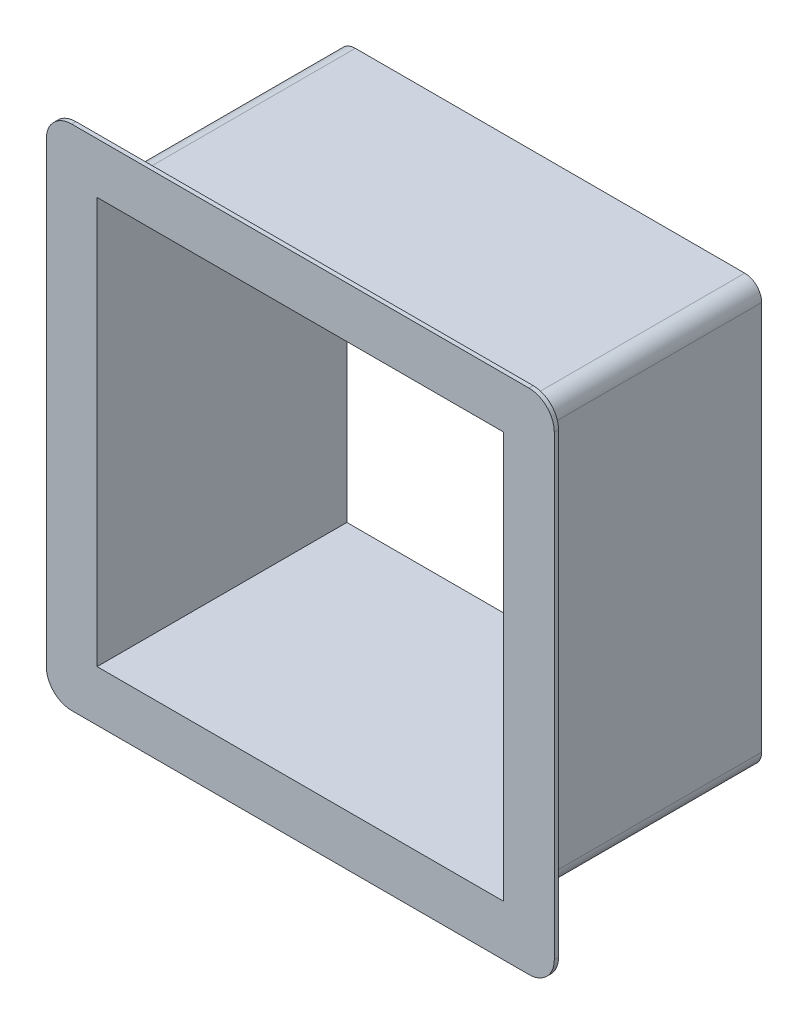
ISO-10303-21;
HEADER;
FILE_DESCRIPTION(('STEP AP214'),'2;1');
FILE_NAME('part.step','',(''),(''),'','','');
FILE_SCHEMA(('AUTOMOTIVE_DESIGN { 1 0 10303 214 1 1 1 1 }'));
ENDSEC;
DATA;
#1=APPLICATION_CONTEXT('core data for automotive mechanical design processes');
#2=APPLICATION_PROTOCOL_DEFINITION('international standard','automotive_design',2000,#1);
#3=PRODUCT_CONTEXT('',#1,'mechanical');
#4=PRODUCT('Part','Part','',(#3));
#5=PRODUCT_RELATED_PRODUCT_CATEGORY('part','',(#4));
#6=PRODUCT_DEFINITION_FORMATION('','',#4);
#7=PRODUCT_DEFINITION_CONTEXT('part definition',#1,'design');
#8=PRODUCT_DEFINITION('design','',#6,#7);
#9=PRODUCT_DEFINITION_SHAPE('','',#8);
#10=(LENGTH_UNIT() NAMED_UNIT(*) SI_UNIT(.MILLI.,.METRE.));
#11=(NAMED_UNIT(*) PLANE_ANGLE_UNIT() SI_UNIT($,.RADIAN.));
#12=(NAMED_UNIT(*) SI_UNIT($,.STERADIAN.) SOLID_ANGLE_UNIT());
#13=UNCERTAINTY_MEASURE_WITH_UNIT(LENGTH_MEASURE(1.E-05),#10,'distance_accuracy_value','');
#14=(GEOMETRIC_REPRESENTATION_CONTEXT(3) GLOBAL_UNCERTAINTY_ASSIGNED_CONTEXT((#13)) GLOBAL_UNIT_ASSIGNED_CONTEXT((#10,
#11,#12)) REPRESENTATION_CONTEXT('',''));
#15=CARTESIAN_POINT('',(0.,0.,0.));
#16=DIRECTION('',(0.,0.,1.));
#17=DIRECTION('',(1.,0.,0.));
#18=AXIS2_PLACEMENT_3D('',#15,#16,#17);
#19=CARTESIAN_POINT('',(-50.,-50.,-59.));
#20=DIRECTION('',(0.,-1.,0.));
#21=DIRECTION('',(0.,0.,-1.));
#22=AXIS2_PLACEMENT_3D('',#19,#20,#21);
#23=PLANE('',#22);
#24=DIRECTION('',(1.,0.,0.));
#25=VECTOR('',#24,1.);
#26=CARTESIAN_POINT('',(-50.,-50.,-59.));
#27=LINE('',#26,#25);
#28=CARTESIAN_POINT('',(-46.,-50.,-59.));
#29=VERTEX_POINT('',#28);
#30=CARTESIAN_POINT('',(46.,-50.,-59.));
#31=VERTEX_POINT('',#30);
#32=EDGE_CURVE('E265',#29,#31,#27,.T.);
#33=ORIENTED_EDGE('',*,*,#32,.T.);
#34=DIRECTION('',(0.,0.,1.));
#35=VECTOR('',#34,1.);
#36=CARTESIAN_POINT('',(46.,-50.,-59.));
#37=LINE('',#36,#35);
#38=CARTESIAN_POINT('',(46.,-50.,-1.));
#39=VERTEX_POINT('',#38);
#40=EDGE_CURVE('E282',#31,#39,#37,.T.);
#41=ORIENTED_EDGE('',*,*,#40,.T.);
#42=DIRECTION('',(1.,0.,0.));
#43=VECTOR('',#42,1.);
#44=CARTESIAN_POINT('',(-50.,-50.,-1.));
#45=LINE('',#44,#43);
#46=CARTESIAN_POINT('',(-46.,-50.,-1.));
#47=VERTEX_POINT('',#46);
#48=EDGE_CURVE('E384',#47,#39,#45,.T.);
#49=ORIENTED_EDGE('',*,*,#48,.F.);
#50=DIRECTION('',(0.,0.,1.));
#51=VECTOR('',#50,1.);
#52=CARTESIAN_POINT('',(-46.,-50.,-59.));
#53=LINE('',#52,#51);
#54=EDGE_CURVE('E280',#47,#29,#53,.F.);
#55=ORIENTED_EDGE('',*,*,#54,.T.);
#56=EDGE_LOOP('',(#33,#41,#49,#55));
#57=FACE_BOUND('',#56,.T.);
#58=ADVANCED_FACE('F84',(#57),#23,.T.);
#59=CARTESIAN_POINT('',(-50.,-50.,-59.));
#60=DIRECTION('',(1.,0.,0.));
#61=DIRECTION('',(0.,0.,-1.));
#62=AXIS2_PLACEMENT_3D('',#59,#60,#61);
#63=PLANE('',#62);
#64=DIRECTION('',(0.,1.,0.));
#65=VECTOR('',#64,1.);
#66=CARTESIAN_POINT('',(-50.,-50.,-59.));
#67=LINE('',#66,#65);
#68=CARTESIAN_POINT('',(-50.,-46.,-59.));
#69=VERTEX_POINT('',#68);
#70=CARTESIAN_POINT('',(-50.,46.,-59.));
#71=VERTEX_POINT('',#70);
#72=EDGE_CURVE('E277',#69,#71,#67,.T.);
#73=ORIENTED_EDGE('',*,*,#72,.F.);
#74=DIRECTION('',(0.,0.,1.));
#75=VECTOR('',#74,1.);
#76=CARTESIAN_POINT('',(-50.,-46.,-1.));
#77=LINE('',#76,#75);
#78=CARTESIAN_POINT('',(-50.,-46.,-1.));
#79=VERTEX_POINT('',#78);
#80=EDGE_CURVE('E300',#69,#79,#77,.T.);
#81=ORIENTED_EDGE('',*,*,#80,.T.);
#82=DIRECTION('',(0.,1.,0.));
#83=VECTOR('',#82,1.);
#84=CARTESIAN_POINT('',(-50.,-50.,-1.));
#85=LINE('',#84,#83);
#86=CARTESIAN_POINT('',(-50.,46.,-1.));
#87=VERTEX_POINT('',#86);
#88=EDGE_CURVE('E370',#79,#87,#85,.T.);
#89=ORIENTED_EDGE('',*,*,#88,.T.);
#90=DIRECTION('',(0.,0.,1.));
#91=VECTOR('',#90,1.);
#92=CARTESIAN_POINT('',(-50.,46.,-59.));
#93=LINE('',#92,#91);
#94=EDGE_CURVE('E298',#87,#71,#93,.F.);
#95=ORIENTED_EDGE('',*,*,#94,.T.);
#96=EDGE_LOOP('',(#73,#81,#89,#95));
#97=FACE_BOUND('',#96,.T.);
#98=ADVANCED_FACE('F403',(#97),#63,.F.);
#99=CARTESIAN_POINT('',(-50.,50.,-59.));
#100=DIRECTION('',(0.,-1.,0.));
#101=DIRECTION('',(0.,0.,-1.));
#102=AXIS2_PLACEMENT_3D('',#99,#100,#101);
#103=PLANE('',#102);
#104=DIRECTION('',(1.,0.,0.));
#105=VECTOR('',#104,1.);
#106=CARTESIAN_POINT('',(-50.,50.,-59.));
#107=LINE('',#106,#105);
#108=CARTESIAN_POINT('',(-46.,50.,-59.));
#109=VERTEX_POINT('',#108);
#110=CARTESIAN_POINT('',(46.,50.,-59.));
#111=VERTEX_POINT('',#110);
#112=EDGE_CURVE('E274',#109,#111,#107,.T.);
#113=ORIENTED_EDGE('',*,*,#112,.F.);
#114=DIRECTION('',(0.,0.,1.));
#115=VECTOR('',#114,1.);
#116=CARTESIAN_POINT('',(-46.,50.,-59.));
#117=LINE('',#116,#115);
#118=CARTESIAN_POINT('',(-46.,50.,-1.));
#119=VERTEX_POINT('',#118);
#120=EDGE_CURVE('E305',#109,#119,#117,.T.);
#121=ORIENTED_EDGE('',*,*,#120,.T.);
#122=DIRECTION('',(1.,0.,0.));
#123=VECTOR('',#122,1.);
#124=CARTESIAN_POINT('',(-50.,50.,-1.));
#125=LINE('',#124,#123);
#126=CARTESIAN_POINT('',(46.,50.,-1.));
#127=VERTEX_POINT('',#126);
#128=EDGE_CURVE('E378',#119,#127,#125,.T.);
#129=ORIENTED_EDGE('',*,*,#128,.T.);
#130=DIRECTION('',(0.,0.,1.));
#131=VECTOR('',#130,1.);
#132=CARTESIAN_POINT('',(46.,50.,-59.));
#133=LINE('',#132,#131);
#134=EDGE_CURVE('E303',#127,#111,#133,.F.);
#135=ORIENTED_EDGE('',*,*,#134,.T.);
#136=EDGE_LOOP('',(#113,#121,#129,#135));
#137=FACE_BOUND('',#136,.T.);
#138=ADVANCED_FACE('F411',(#137),#103,.F.);
#139=CARTESIAN_POINT('',(50.,-50.,-59.));
#140=DIRECTION('',(1.,0.,0.));
#141=DIRECTION('',(0.,0.,-1.));
#142=AXIS2_PLACEMENT_3D('',#139,#140,#141);
#143=PLANE('',#142);
#144=DIRECTION('',(0.,1.,0.));
#145=VECTOR('',#144,1.);
#146=CARTESIAN_POINT('',(50.,-50.,-1.));
#147=LINE('',#146,#145);
#148=CARTESIAN_POINT('',(50.,-46.,-1.));
#149=VERTEX_POINT('',#148);
#150=CARTESIAN_POINT('',(50.,46.,-1.));
#151=VERTEX_POINT('',#150);
#152=EDGE_CURVE('E381',#149,#151,#147,.T.);
#153=ORIENTED_EDGE('',*,*,#152,.F.);
#154=DIRECTION('',(0.,0.,1.));
#155=VECTOR('',#154,1.);
#156=CARTESIAN_POINT('',(50.,-46.,-59.));
#157=LINE('',#156,#155);
#158=CARTESIAN_POINT('',(50.,-46.,-59.));
#159=VERTEX_POINT('',#158);
#160=EDGE_CURVE('E288',#149,#159,#157,.F.);
#161=ORIENTED_EDGE('',*,*,#160,.T.);
#162=DIRECTION('',(0.,1.,0.));
#163=VECTOR('',#162,1.);
#164=CARTESIAN_POINT('',(50.,-50.,-59.));
#165=LINE('',#164,#163);
#166=CARTESIAN_POINT('',(50.,46.,-59.));
#167=VERTEX_POINT('',#166);
#168=EDGE_CURVE('E271',#159,#167,#165,.T.);
#169=ORIENTED_EDGE('',*,*,#168,.T.);
#170=DIRECTION('',(0.,0.,1.));
#171=VECTOR('',#170,1.);
#172=CARTESIAN_POINT('',(50.,46.,-1.));
#173=LINE('',#172,#171);
#174=EDGE_CURVE('E285',#167,#151,#173,.T.);
#175=ORIENTED_EDGE('',*,*,#174,.T.);
#176=EDGE_LOOP('',(#153,#161,#169,#175));
#177=FACE_BOUND('',#176,.T.);
#178=ADVANCED_FACE('F419',(#177),#143,.T.);
#179=CARTESIAN_POINT('',(0.,0.,-59.));
#180=DIRECTION('',(0.,0.,1.));
#181=DIRECTION('',(1.,0.,0.));
#182=AXIS2_PLACEMENT_3D('',#179,#180,#181);
#183=PLANE('',#182);
#184=DIRECTION('',(0.,1.,0.));
#185=VECTOR('',#184,1.);
#186=CARTESIAN_POINT('',(-48.,-48.,-59.));
#187=LINE('',#186,#185);
#188=CARTESIAN_POINT('',(-48.,-48.,-59.));
#189=VERTEX_POINT('',#188);
#190=CARTESIAN_POINT('',(-48.,48.,-59.));
#191=VERTEX_POINT('',#190);
#192=EDGE_CURVE('E234',#189,#191,#187,.T.);
#193=ORIENTED_EDGE('',*,*,#192,.F.);
#194=DIRECTION('',(1.,0.,0.));
#195=VECTOR('',#194,1.);
#196=CARTESIAN_POINT('',(-48.,-48.,-59.));
#197=LINE('',#196,#195);
#198=CARTESIAN_POINT('',(48.,-48.,-59.));
#199=VERTEX_POINT('',#198);
#200=EDGE_CURVE('E226',#189,#199,#197,.T.);
#201=ORIENTED_EDGE('',*,*,#200,.T.);
#202=DIRECTION('',(0.,1.,0.));
#203=VECTOR('',#202,1.);
#204=CARTESIAN_POINT('',(48.,-48.,-59.));
#205=LINE('',#204,#203);
#206=CARTESIAN_POINT('',(48.,48.,-59.));
#207=VERTEX_POINT('',#206);
#208=EDGE_CURVE('E237',#199,#207,#205,.T.);
#209=ORIENTED_EDGE('',*,*,#208,.T.);
#210=DIRECTION('',(1.,0.,0.));
#211=VECTOR('',#210,1.);
#212=CARTESIAN_POINT('',(-48.,48.,-59.));
#213=LINE('',#212,#211);
#214=EDGE_CURVE('E242',#191,#207,#213,.T.);
#215=ORIENTED_EDGE('',*,*,#214,.F.);
#216=EDGE_LOOP('',(#193,#201,#209,#215));
#217=FACE_BOUND('',#216,.T.);
#218=ORIENTED_EDGE('',*,*,#168,.F.);
#219=CARTESIAN_POINT('',(46.,-46.,-59.));
#220=DIRECTION('',(0.,0.,1.));
#221=DIRECTION('',(1.,0.,0.));
#222=AXIS2_PLACEMENT_3D('',#219,#220,#221);
#223=CIRCLE('',#222,4.);
#224=EDGE_CURVE('E296',#159,#31,#223,.F.);
#225=ORIENTED_EDGE('',*,*,#224,.T.);
#226=ORIENTED_EDGE('',*,*,#32,.F.);
#227=CARTESIAN_POINT('',(-46.,-46.,-59.));
#228=DIRECTION('',(0.,0.,1.));
#229=DIRECTION('',(1.,0.,0.));
#230=AXIS2_PLACEMENT_3D('',#227,#228,#229);
#231=CIRCLE('',#230,4.);
#232=EDGE_CURVE('E294',#29,#69,#231,.F.);
#233=ORIENTED_EDGE('',*,*,#232,.T.);
#234=ORIENTED_EDGE('',*,*,#72,.T.);
#235=CARTESIAN_POINT('',(-46.,46.,-59.));
#236=DIRECTION('',(0.,0.,1.));
#237=DIRECTION('',(1.,0.,0.));
#238=AXIS2_PLACEMENT_3D('',#235,#236,#237);
#239=CIRCLE('',#238,4.);
#240=EDGE_CURVE('E292',#71,#109,#239,.F.);
#241=ORIENTED_EDGE('',*,*,#240,.T.);
#242=ORIENTED_EDGE('',*,*,#112,.T.);
#243=CARTESIAN_POINT('',(46.,46.,-59.));
#244=DIRECTION('',(0.,0.,1.));
#245=DIRECTION('',(1.,0.,0.));
#246=AXIS2_PLACEMENT_3D('',#243,#244,#245);
#247=CIRCLE('',#246,4.);
#248=EDGE_CURVE('E290',#111,#167,#247,.F.);
#249=ORIENTED_EDGE('',*,*,#248,.T.);
#250=EDGE_LOOP('',(#218,#225,#226,#233,#234,#241,#242,#249));
#251=FACE_BOUND('',#250,.T.);
#252=ADVANCED_FACE('F244',(#217,#251),#183,.F.);
#253=CARTESIAN_POINT('',(0.,0.,0.));
#254=DIRECTION('',(0.,0.,1.));
#255=DIRECTION('',(1.,0.,0.));
#256=AXIS2_PLACEMENT_3D('',#253,#254,#255);
#257=PLANE('',#256);
#258=DIRECTION('',(1.,0.,0.));
#259=VECTOR('',#258,1.);
#260=CARTESIAN_POINT('',(-48.,-48.,0.));
#261=LINE('',#260,#259);
#262=CARTESIAN_POINT('',(-48.,-48.,0.));
#263=VERTEX_POINT('',#262);
#264=CARTESIAN_POINT('',(48.,-48.,0.));
#265=VERTEX_POINT('',#264);
#266=EDGE_CURVE('E229',#263,#265,#261,.T.);
#267=ORIENTED_EDGE('',*,*,#266,.F.);
#268=DIRECTION('',(0.,1.,0.));
#269=VECTOR('',#268,1.);
#270=CARTESIAN_POINT('',(-48.,-48.,0.));
#271=LINE('',#270,#269);
#272=CARTESIAN_POINT('',(-48.,48.,0.));
#273=VERTEX_POINT('',#272);
#274=EDGE_CURVE('E246',#263,#273,#271,.T.);
#275=ORIENTED_EDGE('',*,*,#274,.T.);
#276=DIRECTION('',(1.,0.,0.));
#277=VECTOR('',#276,1.);
#278=CARTESIAN_POINT('',(-48.,48.,0.));
#279=LINE('',#278,#277);
#280=CARTESIAN_POINT('',(48.,48.,0.));
#281=VERTEX_POINT('',#280);
#282=EDGE_CURVE('E249',#273,#281,#279,.T.);
#283=ORIENTED_EDGE('',*,*,#282,.T.);
#284=DIRECTION('',(0.,1.,0.));
#285=VECTOR('',#284,1.);
#286=CARTESIAN_POINT('',(48.,-48.,0.));
#287=LINE('',#286,#285);
#288=EDGE_CURVE('E258',#265,#281,#287,.T.);
#289=ORIENTED_EDGE('',*,*,#288,.F.);
#290=EDGE_LOOP('',(#267,#275,#283,#289));
#291=FACE_BOUND('',#290,.T.);
#292=DIRECTION('',(1.,0.,0.));
#293=VECTOR('',#292,1.);
#294=CARTESIAN_POINT('',(-60.,-60.,0.));
#295=LINE('',#294,#293);
#296=CARTESIAN_POINT('',(-54.,-60.,0.));
#297=VERTEX_POINT('',#296);
#298=CARTESIAN_POINT('',(54.,-60.,0.));
#299=VERTEX_POINT('',#298);
#300=EDGE_CURVE('E366',#297,#299,#295,.T.);
#301=ORIENTED_EDGE('',*,*,#300,.T.);
#302=CARTESIAN_POINT('',(54.,-54.,0.));
#303=DIRECTION('',(0.,0.,1.));
#304=DIRECTION('',(1.,0.,0.));
#305=AXIS2_PLACEMENT_3D('',#302,#303,#304);
#306=CIRCLE('',#305,6.);
#307=CARTESIAN_POINT('',(60.,-54.,0.));
#308=VERTEX_POINT('',#307);
#309=EDGE_CURVE('E327',#299,#308,#306,.T.);
#310=ORIENTED_EDGE('',*,*,#309,.T.);
#311=DIRECTION('',(0.,1.,0.));
#312=VECTOR('',#311,1.);
#313=CARTESIAN_POINT('',(60.,-60.,0.));
#314=LINE('',#313,#312);
#315=CARTESIAN_POINT('',(60.,54.,0.));
#316=VERTEX_POINT('',#315);
#317=EDGE_CURVE('E364',#308,#316,#314,.T.);
#318=ORIENTED_EDGE('',*,*,#317,.T.);
#319=CARTESIAN_POINT('',(54.,54.,0.));
#320=DIRECTION('',(0.,0.,1.));
#321=DIRECTION('',(1.,0.,0.));
#322=AXIS2_PLACEMENT_3D('',#319,#320,#321);
#323=CIRCLE('',#322,6.);
#324=CARTESIAN_POINT('',(54.,60.,0.));
#325=VERTEX_POINT('',#324);
#326=EDGE_CURVE('E321',#316,#325,#323,.T.);
#327=ORIENTED_EDGE('',*,*,#326,.T.);
#328=DIRECTION('',(1.,0.,0.));
#329=VECTOR('',#328,1.);
#330=CARTESIAN_POINT('',(-60.,60.,0.));
#331=LINE('',#330,#329);
#332=CARTESIAN_POINT('',(-54.,60.,0.));
#333=VERTEX_POINT('',#332);
#334=EDGE_CURVE('E360',#333,#325,#331,.T.);
#335=ORIENTED_EDGE('',*,*,#334,.F.);
#336=CARTESIAN_POINT('',(-54.,54.,0.));
#337=DIRECTION('',(0.,0.,1.));
#338=DIRECTION('',(1.,0.,0.));
#339=AXIS2_PLACEMENT_3D('',#336,#337,#338);
#340=CIRCLE('',#339,6.);
#341=CARTESIAN_POINT('',(-60.,54.,0.));
#342=VERTEX_POINT('',#341);
#343=EDGE_CURVE('E323',#333,#342,#340,.T.);
#344=ORIENTED_EDGE('',*,*,#343,.T.);
#345=DIRECTION('',(0.,1.,0.));
#346=VECTOR('',#345,1.);
#347=CARTESIAN_POINT('',(-60.,-60.,0.));
#348=LINE('',#347,#346);
#349=CARTESIAN_POINT('',(-60.,-54.,0.));
#350=VERTEX_POINT('',#349);
#351=EDGE_CURVE('E252',#350,#342,#348,.T.);
#352=ORIENTED_EDGE('',*,*,#351,.F.);
#353=CARTESIAN_POINT('',(-54.,-54.,0.));
#354=DIRECTION('',(0.,0.,1.));
#355=DIRECTION('',(1.,0.,0.));
#356=AXIS2_PLACEMENT_3D('',#353,#354,#355);
#357=CIRCLE('',#356,6.);
#358=EDGE_CURVE('E325',#350,#297,#357,.T.);
#359=ORIENTED_EDGE('',*,*,#358,.T.);
#360=EDGE_LOOP('',(#301,#310,#318,#327,#335,#344,#352,#359));
#361=FACE_BOUND('',#360,.T.);
#362=ADVANCED_FACE('F356',(#291,#361),#257,.T.);
#363=CARTESIAN_POINT('',(-48.,-48.,-59.));
#364=DIRECTION('',(0.,-1.,0.));
#365=DIRECTION('',(0.,0.,-1.));
#366=AXIS2_PLACEMENT_3D('',#363,#364,#365);
#367=PLANE('',#366);
#368=ORIENTED_EDGE('',*,*,#266,.T.);
#369=DIRECTION('',(0.,0.,1.));
#370=VECTOR('',#369,1.);
#371=CARTESIAN_POINT('',(48.,-48.,-59.));
#372=LINE('',#371,#370);
#373=EDGE_CURVE('E222',#199,#265,#372,.T.);
#374=ORIENTED_EDGE('',*,*,#373,.F.);
#375=ORIENTED_EDGE('',*,*,#200,.F.);
#376=DIRECTION('',(0.,0.,1.));
#377=VECTOR('',#376,1.);
#378=CARTESIAN_POINT('',(-48.,-48.,-59.));
#379=LINE('',#378,#377);
#380=EDGE_CURVE('E263',#189,#263,#379,.T.);
#381=ORIENTED_EDGE('',*,*,#380,.T.);
#382=EDGE_LOOP('',(#368,#374,#375,#381));
#383=FACE_BOUND('',#382,.T.);
#384=ADVANCED_FACE('F224',(#383),#367,.F.);
#385=CARTESIAN_POINT('',(-48.,-48.,-59.));
#386=DIRECTION('',(1.,0.,0.));
#387=DIRECTION('',(0.,0.,-1.));
#388=AXIS2_PLACEMENT_3D('',#385,#386,#387);
#389=PLANE('',#388);
#390=ORIENTED_EDGE('',*,*,#274,.F.);
#391=ORIENTED_EDGE('',*,*,#380,.F.);
#392=ORIENTED_EDGE('',*,*,#192,.T.);
#393=DIRECTION('',(0.,0.,1.));
#394=VECTOR('',#393,1.);
#395=CARTESIAN_POINT('',(-48.,48.,-59.));
#396=LINE('',#395,#394);
#397=EDGE_CURVE('E266',#191,#273,#396,.T.);
#398=ORIENTED_EDGE('',*,*,#397,.T.);
#399=EDGE_LOOP('',(#390,#391,#392,#398));
#400=FACE_BOUND('',#399,.T.);
#401=ADVANCED_FACE('F452',(#400),#389,.T.);
#402=CARTESIAN_POINT('',(-48.,48.,-59.));
#403=DIRECTION('',(0.,-1.,0.));
#404=DIRECTION('',(0.,0.,-1.));
#405=AXIS2_PLACEMENT_3D('',#402,#403,#404);
#406=PLANE('',#405);
#407=ORIENTED_EDGE('',*,*,#282,.F.);
#408=ORIENTED_EDGE('',*,*,#397,.F.);
#409=ORIENTED_EDGE('',*,*,#214,.T.);
#410=DIRECTION('',(0.,0.,1.));
#411=VECTOR('',#410,1.);
#412=CARTESIAN_POINT('',(48.,48.,-59.));
#413=LINE('',#412,#411);
#414=EDGE_CURVE('E233',#207,#281,#413,.T.);
#415=ORIENTED_EDGE('',*,*,#414,.T.);
#416=EDGE_LOOP('',(#407,#408,#409,#415));
#417=FACE_BOUND('',#416,.T.);
#418=ADVANCED_FACE('F456',(#417),#406,.T.);
#419=CARTESIAN_POINT('',(48.,-48.,-59.));
#420=DIRECTION('',(1.,0.,0.));
#421=DIRECTION('',(0.,0.,-1.));
#422=AXIS2_PLACEMENT_3D('',#419,#420,#421);
#423=PLANE('',#422);
#424=ORIENTED_EDGE('',*,*,#288,.T.);
#425=ORIENTED_EDGE('',*,*,#414,.F.);
#426=ORIENTED_EDGE('',*,*,#208,.F.);
#427=ORIENTED_EDGE('',*,*,#373,.T.);
#428=EDGE_LOOP('',(#424,#425,#426,#427));
#429=FACE_BOUND('',#428,.T.);
#430=ADVANCED_FACE('F238',(#429),#423,.F.);
#431=CARTESIAN_POINT('',(-60.,-60.,-1.));
#432=DIRECTION('',(0.,-1.,0.));
#433=DIRECTION('',(0.,0.,-1.));
#434=AXIS2_PLACEMENT_3D('',#431,#432,#433);
#435=PLANE('',#434);
#436=DIRECTION('',(1.,0.,0.));
#437=VECTOR('',#436,1.);
#438=CARTESIAN_POINT('',(-60.,-60.,-1.));
#439=LINE('',#438,#437);
#440=CARTESIAN_POINT('',(-54.,-60.,-1.));
#441=VERTEX_POINT('',#440);
#442=CARTESIAN_POINT('',(54.,-60.,-1.));
#443=VERTEX_POINT('',#442);
#444=EDGE_CURVE('E359',#441,#443,#439,.T.);
#445=ORIENTED_EDGE('',*,*,#444,.T.);
#446=DIRECTION('',(0.,0.,1.));
#447=VECTOR('',#446,1.);
#448=CARTESIAN_POINT('',(54.,-60.,-1.));
#449=LINE('',#448,#447);
#450=EDGE_CURVE('E318',#443,#299,#449,.T.);
#451=ORIENTED_EDGE('',*,*,#450,.T.);
#452=ORIENTED_EDGE('',*,*,#300,.F.);
#453=DIRECTION('',(0.,0.,1.));
#454=VECTOR('',#453,1.);
#455=CARTESIAN_POINT('',(-54.,-60.,-1.));
#456=LINE('',#455,#454);
#457=EDGE_CURVE('E316',#297,#441,#456,.F.);
#458=ORIENTED_EDGE('',*,*,#457,.T.);
#459=EDGE_LOOP('',(#445,#451,#452,#458));
#460=FACE_BOUND('',#459,.T.);
#461=ADVANCED_FACE('F455',(#460),#435,.T.);
#462=CARTESIAN_POINT('',(-60.,-60.,-1.));
#463=DIRECTION('',(1.,0.,0.));
#464=DIRECTION('',(0.,0.,-1.));
#465=AXIS2_PLACEMENT_3D('',#462,#463,#464);
#466=PLANE('',#465);
#467=DIRECTION('',(0.,1.,0.));
#468=VECTOR('',#467,1.);
#469=CARTESIAN_POINT('',(-60.,-60.,-1.));
#470=LINE('',#469,#468);
#471=CARTESIAN_POINT('',(-60.,-54.,-1.));
#472=VERTEX_POINT('',#471);
#473=CARTESIAN_POINT('',(-60.,54.,-1.));
#474=VERTEX_POINT('',#473);
#475=EDGE_CURVE('E259',#472,#474,#470,.T.);
#476=ORIENTED_EDGE('',*,*,#475,.F.);
#477=DIRECTION('',(0.,0.,1.));
#478=VECTOR('',#477,1.);
#479=CARTESIAN_POINT('',(-60.,-54.,0.));
#480=LINE('',#479,#478);
#481=EDGE_CURVE('E343',#472,#350,#480,.T.);
#482=ORIENTED_EDGE('',*,*,#481,.T.);
#483=ORIENTED_EDGE('',*,*,#351,.T.);
#484=DIRECTION('',(0.,0.,1.));
#485=VECTOR('',#484,1.);
#486=CARTESIAN_POINT('',(-60.,54.,-1.));
#487=LINE('',#486,#485);
#488=EDGE_CURVE('E341',#342,#474,#487,.F.);
#489=ORIENTED_EDGE('',*,*,#488,.T.);
#490=EDGE_LOOP('',(#476,#482,#483,#489));
#491=FACE_BOUND('',#490,.T.);
#492=ADVANCED_FACE('F350',(#491),#466,.F.);
#493=CARTESIAN_POINT('',(-60.,60.,-1.));
#494=DIRECTION('',(0.,-1.,0.));
#495=DIRECTION('',(0.,0.,-1.));
#496=AXIS2_PLACEMENT_3D('',#493,#494,#495);
#497=PLANE('',#496);
#498=DIRECTION('',(1.,0.,0.));
#499=VECTOR('',#498,1.);
#500=CARTESIAN_POINT('',(-60.,60.,-1.));
#501=LINE('',#500,#499);
#502=CARTESIAN_POINT('',(-54.,60.,-1.));
#503=VERTEX_POINT('',#502);
#504=CARTESIAN_POINT('',(54.,60.,-1.));
#505=VERTEX_POINT('',#504);
#506=EDGE_CURVE('E372',#503,#505,#501,.T.);
#507=ORIENTED_EDGE('',*,*,#506,.F.);
#508=DIRECTION('',(0.,0.,1.));
#509=VECTOR('',#508,1.);
#510=CARTESIAN_POINT('',(-54.,60.,-1.));
#511=LINE('',#510,#509);
#512=EDGE_CURVE('E12',#503,#333,#511,.T.);
#513=ORIENTED_EDGE('',*,*,#512,.T.);
#514=ORIENTED_EDGE('',*,*,#334,.T.);
#515=DIRECTION('',(0.,0.,1.));
#516=VECTOR('',#515,1.);
#517=CARTESIAN_POINT('',(54.,60.,-1.));
#518=LINE('',#517,#516);
#519=EDGE_CURVE('E92',#325,#505,#518,.F.);
#520=ORIENTED_EDGE('',*,*,#519,.T.);
#521=EDGE_LOOP('',(#507,#513,#514,#520));
#522=FACE_BOUND('',#521,.T.);
#523=ADVANCED_FACE('F468',(#522),#497,.F.);
#524=CARTESIAN_POINT('',(60.,-60.,-1.));
#525=DIRECTION('',(1.,0.,0.));
#526=DIRECTION('',(0.,0.,-1.));
#527=AXIS2_PLACEMENT_3D('',#524,#525,#526);
#528=PLANE('',#527);
#529=ORIENTED_EDGE('',*,*,#317,.F.);
#530=DIRECTION('',(0.,0.,1.));
#531=VECTOR('',#530,1.);
#532=CARTESIAN_POINT('',(60.,-54.,-1.));
#533=LINE('',#532,#531);
#534=CARTESIAN_POINT('',(60.,-54.,-1.));
#535=VERTEX_POINT('',#534);
#536=EDGE_CURVE('E332',#308,#535,#533,.F.);
#537=ORIENTED_EDGE('',*,*,#536,.T.);
#538=DIRECTION('',(0.,1.,0.));
#539=VECTOR('',#538,1.);
#540=CARTESIAN_POINT('',(60.,-60.,-1.));
#541=LINE('',#540,#539);
#542=CARTESIAN_POINT('',(60.,54.,-1.));
#543=VERTEX_POINT('',#542);
#544=EDGE_CURVE('E362',#535,#543,#541,.T.);
#545=ORIENTED_EDGE('',*,*,#544,.T.);
#546=DIRECTION('',(0.,0.,1.));
#547=VECTOR('',#546,1.);
#548=CARTESIAN_POINT('',(60.,54.,0.));
#549=LINE('',#548,#547);
#550=EDGE_CURVE('E329',#543,#316,#549,.T.);
#551=ORIENTED_EDGE('',*,*,#550,.T.);
#552=EDGE_LOOP('',(#529,#537,#545,#551));
#553=FACE_BOUND('',#552,.T.);
#554=ADVANCED_FACE('F431',(#553),#528,.T.);
#555=CARTESIAN_POINT('',(0.,0.,-1.));
#556=DIRECTION('',(0.,0.,1.));
#557=DIRECTION('',(1.,0.,0.));
#558=AXIS2_PLACEMENT_3D('',#555,#556,#557);
#559=PLANE('',#558);
#560=ORIENTED_EDGE('',*,*,#88,.F.);
#561=CARTESIAN_POINT('',(-46.,-46.,-1.));
#562=DIRECTION('',(0.,0.,1.));
#563=DIRECTION('',(1.,0.,0.));
#564=AXIS2_PLACEMENT_3D('',#561,#562,#563);
#565=CIRCLE('',#564,4.);
#566=EDGE_CURVE('E310',#79,#47,#565,.T.);
#567=ORIENTED_EDGE('',*,*,#566,.T.);
#568=ORIENTED_EDGE('',*,*,#48,.T.);
#569=CARTESIAN_POINT('',(46.,-46.,-1.));
#570=DIRECTION('',(0.,0.,1.));
#571=DIRECTION('',(1.,0.,0.));
#572=AXIS2_PLACEMENT_3D('',#569,#570,#571);
#573=CIRCLE('',#572,4.);
#574=EDGE_CURVE('E308',#39,#149,#573,.T.);
#575=ORIENTED_EDGE('',*,*,#574,.T.);
#576=ORIENTED_EDGE('',*,*,#152,.T.);
#577=CARTESIAN_POINT('',(46.,46.,-1.));
#578=DIRECTION('',(0.,0.,1.));
#579=DIRECTION('',(1.,0.,0.));
#580=AXIS2_PLACEMENT_3D('',#577,#578,#579);
#581=CIRCLE('',#580,4.);
#582=EDGE_CURVE('E314',#151,#127,#581,.T.);
#583=ORIENTED_EDGE('',*,*,#582,.T.);
#584=ORIENTED_EDGE('',*,*,#128,.F.);
#585=CARTESIAN_POINT('',(-46.,46.,-1.));
#586=DIRECTION('',(0.,0.,1.));
#587=DIRECTION('',(1.,0.,0.));
#588=AXIS2_PLACEMENT_3D('',#585,#586,#587);
#589=CIRCLE('',#588,4.);
#590=EDGE_CURVE('E312',#119,#87,#589,.T.);
#591=ORIENTED_EDGE('',*,*,#590,.T.);
#592=EDGE_LOOP('',(#560,#567,#568,#575,#576,#583,#584,#591));
#593=FACE_BOUND('',#592,.T.);
#594=ORIENTED_EDGE('',*,*,#544,.F.);
#595=CARTESIAN_POINT('',(54.,-54.,-1.));
#596=DIRECTION('',(0.,0.,1.));
#597=DIRECTION('',(1.,0.,0.));
#598=AXIS2_PLACEMENT_3D('',#595,#596,#597);
#599=CIRCLE('',#598,6.);
#600=EDGE_CURVE('E339',#535,#443,#599,.F.);
#601=ORIENTED_EDGE('',*,*,#600,.T.);
#602=ORIENTED_EDGE('',*,*,#444,.F.);
#603=CARTESIAN_POINT('',(-54.,-54.,-1.));
#604=DIRECTION('',(0.,0.,1.));
#605=DIRECTION('',(1.,0.,0.));
#606=AXIS2_PLACEMENT_3D('',#603,#604,#605);
#607=CIRCLE('',#606,6.);
#608=EDGE_CURVE('E337',#441,#472,#607,.F.);
#609=ORIENTED_EDGE('',*,*,#608,.T.);
#610=ORIENTED_EDGE('',*,*,#475,.T.);
#611=CARTESIAN_POINT('',(-54.,54.,-1.));
#612=DIRECTION('',(0.,0.,1.));
#613=DIRECTION('',(1.,0.,0.));
#614=AXIS2_PLACEMENT_3D('',#611,#612,#613);
#615=CIRCLE('',#614,6.);
#616=EDGE_CURVE('E105',#474,#503,#615,.F.);
#617=ORIENTED_EDGE('',*,*,#616,.T.);
#618=ORIENTED_EDGE('',*,*,#506,.T.);
#619=CARTESIAN_POINT('',(54.,54.,-1.));
#620=DIRECTION('',(0.,0.,1.));
#621=DIRECTION('',(1.,0.,0.));
#622=AXIS2_PLACEMENT_3D('',#619,#620,#621);
#623=CIRCLE('',#622,6.);
#624=EDGE_CURVE('E334',#505,#543,#623,.F.);
#625=ORIENTED_EDGE('',*,*,#624,.T.);
#626=EDGE_LOOP('',(#594,#601,#602,#609,#610,#617,#618,#625));
#627=FACE_BOUND('',#626,.T.);
#628=ADVANCED_FACE('F389',(#593,#627),#559,.F.);
#629=CARTESIAN_POINT('',(46.,-46.,-59.));
#630=DIRECTION('',(0.,0.,1.));
#631=DIRECTION('',(1.,0.,0.));
#632=AXIS2_PLACEMENT_3D('',#629,#630,#631);
#633=CYLINDRICAL_SURFACE('',#632,4.);
#634=ORIENTED_EDGE('',*,*,#224,.F.);
#635=ORIENTED_EDGE('',*,*,#160,.F.);
#636=ORIENTED_EDGE('',*,*,#574,.F.);
#637=ORIENTED_EDGE('',*,*,#40,.F.);
#638=EDGE_LOOP('',(#634,#635,#636,#637));
#639=FACE_BOUND('',#638,.T.);
#640=ADVANCED_FACE('F422',(#639),#633,.T.);
#641=CARTESIAN_POINT('',(-46.,-46.,-59.));
#642=DIRECTION('',(0.,0.,-1.));
#643=DIRECTION('',(-1.,0.,0.));
#644=AXIS2_PLACEMENT_3D('',#641,#642,#643);
#645=CYLINDRICAL_SURFACE('',#644,4.);
#646=ORIENTED_EDGE('',*,*,#232,.F.);
#647=ORIENTED_EDGE('',*,*,#54,.F.);
#648=ORIENTED_EDGE('',*,*,#566,.F.);
#649=ORIENTED_EDGE('',*,*,#80,.F.);
#650=EDGE_LOOP('',(#646,#647,#648,#649));
#651=FACE_BOUND('',#650,.T.);
#652=ADVANCED_FACE('F397',(#651),#645,.T.);
#653=CARTESIAN_POINT('',(-46.,46.,-59.));
#654=DIRECTION('',(0.,0.,1.));
#655=DIRECTION('',(1.,0.,0.));
#656=AXIS2_PLACEMENT_3D('',#653,#654,#655);
#657=CYLINDRICAL_SURFACE('',#656,4.);
#658=ORIENTED_EDGE('',*,*,#240,.F.);
#659=ORIENTED_EDGE('',*,*,#94,.F.);
#660=ORIENTED_EDGE('',*,*,#590,.F.);
#661=ORIENTED_EDGE('',*,*,#120,.F.);
#662=EDGE_LOOP('',(#658,#659,#660,#661));
#663=FACE_BOUND('',#662,.T.);
#664=ADVANCED_FACE('F406',(#663),#657,.T.);
#665=CARTESIAN_POINT('',(46.,46.,-59.));
#666=DIRECTION('',(0.,0.,-1.));
#667=DIRECTION('',(-1.,0.,0.));
#668=AXIS2_PLACEMENT_3D('',#665,#666,#667);
#669=CYLINDRICAL_SURFACE('',#668,4.);
#670=ORIENTED_EDGE('',*,*,#248,.F.);
#671=ORIENTED_EDGE('',*,*,#134,.F.);
#672=ORIENTED_EDGE('',*,*,#582,.F.);
#673=ORIENTED_EDGE('',*,*,#174,.F.);
#674=EDGE_LOOP('',(#670,#671,#672,#673));
#675=FACE_BOUND('',#674,.T.);
#676=ADVANCED_FACE('F415',(#675),#669,.T.);
#677=CARTESIAN_POINT('',(54.,-54.,-1.));
#678=DIRECTION('',(0.,0.,1.));
#679=DIRECTION('',(1.,0.,0.));
#680=AXIS2_PLACEMENT_3D('',#677,#678,#679);
#681=CYLINDRICAL_SURFACE('',#680,6.);
#682=ORIENTED_EDGE('',*,*,#600,.F.);
#683=ORIENTED_EDGE('',*,*,#536,.F.);
#684=ORIENTED_EDGE('',*,*,#309,.F.);
#685=ORIENTED_EDGE('',*,*,#450,.F.);
#686=EDGE_LOOP('',(#682,#683,#684,#685));
#687=FACE_BOUND('',#686,.T.);
#688=ADVANCED_FACE('F491',(#687),#681,.T.);
#689=CARTESIAN_POINT('',(-54.,-54.,-1.));
#690=DIRECTION('',(0.,0.,-1.));
#691=DIRECTION('',(-1.,0.,0.));
#692=AXIS2_PLACEMENT_3D('',#689,#690,#691);
#693=CYLINDRICAL_SURFACE('',#692,6.);
#694=ORIENTED_EDGE('',*,*,#608,.F.);
#695=ORIENTED_EDGE('',*,*,#457,.F.);
#696=ORIENTED_EDGE('',*,*,#358,.F.);
#697=ORIENTED_EDGE('',*,*,#481,.F.);
#698=EDGE_LOOP('',(#694,#695,#696,#697));
#699=FACE_BOUND('',#698,.T.);
#700=ADVANCED_FACE('F496',(#699),#693,.T.);
#701=CARTESIAN_POINT('',(-54.,54.,-1.));
#702=DIRECTION('',(0.,0.,1.));
#703=DIRECTION('',(1.,0.,0.));
#704=AXIS2_PLACEMENT_3D('',#701,#702,#703);
#705=CYLINDRICAL_SURFACE('',#704,6.);
#706=ORIENTED_EDGE('',*,*,#616,.F.);
#707=ORIENTED_EDGE('',*,*,#488,.F.);
#708=ORIENTED_EDGE('',*,*,#343,.F.);
#709=ORIENTED_EDGE('',*,*,#512,.F.);
#710=EDGE_LOOP('',(#706,#707,#708,#709));
#711=FACE_BOUND('',#710,.T.);
#712=ADVANCED_FACE('F508',(#711),#705,.T.);
#713=CARTESIAN_POINT('',(54.,54.,-1.));
#714=DIRECTION('',(0.,0.,-1.));
#715=DIRECTION('',(-1.,0.,0.));
#716=AXIS2_PLACEMENT_3D('',#713,#714,#715);
#717=CYLINDRICAL_SURFACE('',#716,6.);
#718=ORIENTED_EDGE('',*,*,#624,.F.);
#719=ORIENTED_EDGE('',*,*,#519,.F.);
#720=ORIENTED_EDGE('',*,*,#326,.F.);
#721=ORIENTED_EDGE('',*,*,#550,.F.);
#722=EDGE_LOOP('',(#718,#719,#720,#721));
#723=FACE_BOUND('',#722,.T.);
#724=ADVANCED_FACE('F86',(#723),#717,.T.);
#725=CLOSED_SHELL('',(#58,#98,#138,#178,#252,#362,#384,#401,#418,#430,#461,#492,#523,#554,#628,
#640,#652,#664,#676,#688,#700,#712,#724));
#726=MANIFOLD_SOLID_BREP('B2',#725);
#727=ADVANCED_BREP_SHAPE_REPRESENTATION('',(#18,#726),#14);
#728=SHAPE_DEFINITION_REPRESENTATION(#9,#727);
ENDSEC;
END-ISO-10303-21;
